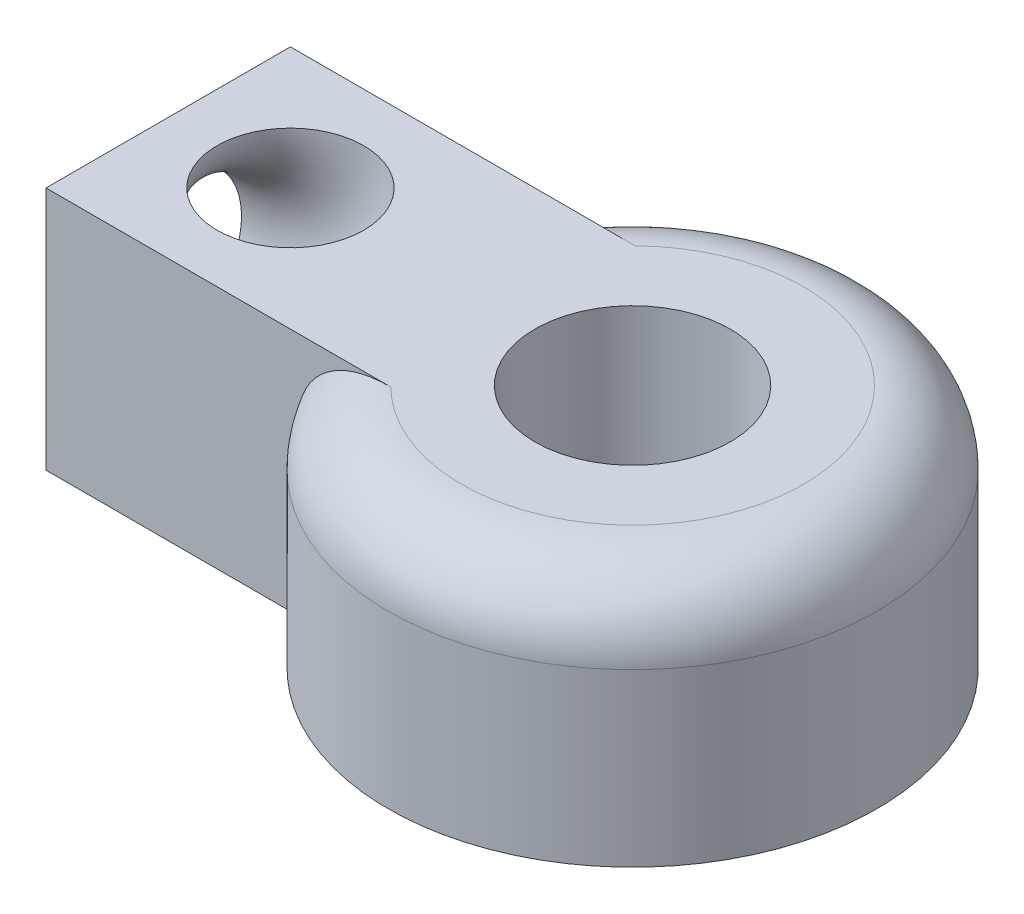
ISO-10303-21;
HEADER;
FILE_DESCRIPTION(('STEP AP214'),'2;1');
FILE_NAME('part.step','',(''),(''),'','','');
FILE_SCHEMA(('AUTOMOTIVE_DESIGN { 1 0 10303 214 1 1 1 1 }'));
ENDSEC;
DATA;
#1=APPLICATION_CONTEXT('core data for automotive mechanical design processes');
#2=APPLICATION_PROTOCOL_DEFINITION('international standard','automotive_design',2000,#1);
#3=PRODUCT_CONTEXT('',#1,'mechanical');
#4=PRODUCT('Part','Part','',(#3));
#5=PRODUCT_RELATED_PRODUCT_CATEGORY('part','',(#4));
#6=PRODUCT_DEFINITION_FORMATION('','',#4);
#7=PRODUCT_DEFINITION_CONTEXT('part definition',#1,'design');
#8=PRODUCT_DEFINITION('design','',#6,#7);
#9=PRODUCT_DEFINITION_SHAPE('','',#8);
#10=(LENGTH_UNIT() NAMED_UNIT(*) SI_UNIT(.MILLI.,.METRE.));
#11=(NAMED_UNIT(*) PLANE_ANGLE_UNIT() SI_UNIT($,.RADIAN.));
#12=(NAMED_UNIT(*) SI_UNIT($,.STERADIAN.) SOLID_ANGLE_UNIT());
#13=UNCERTAINTY_MEASURE_WITH_UNIT(LENGTH_MEASURE(1.E-05),#10,'distance_accuracy_value','');
#14=(GEOMETRIC_REPRESENTATION_CONTEXT(3) GLOBAL_UNCERTAINTY_ASSIGNED_CONTEXT((#13)) GLOBAL_UNIT_ASSIGNED_CONTEXT((#10,
#11,#12)) REPRESENTATION_CONTEXT('',''));
#15=CARTESIAN_POINT('',(0.,0.,0.));
#16=DIRECTION('',(0.,0.,1.));
#17=DIRECTION('',(1.,0.,0.));
#18=AXIS2_PLACEMENT_3D('',#15,#16,#17);
#19=CARTESIAN_POINT('',(0.,10.,0.));
#20=DIRECTION('',(0.,1.,0.));
#21=DIRECTION('',(0.,0.,1.));
#22=AXIS2_PLACEMENT_3D('',#19,#20,#21);
#23=PLANE('',#22);
#24=CARTESIAN_POINT('',(-14.,10.,0.));
#25=DIRECTION('',(0.,1.,0.));
#26=DIRECTION('',(0.,0.,1.));
#27=AXIS2_PLACEMENT_3D('',#24,#25,#26);
#28=CIRCLE('',#27,3.);
#29=CARTESIAN_POINT('',(-11.,10.,0.));
#30=VERTEX_POINT('',#29);
#31=EDGE_CURVE('E116',#30,#30,#28,.F.);
#32=ORIENTED_EDGE('',*,*,#31,.T.);
#33=EDGE_LOOP('',(#32));
#34=FACE_BOUND('',#33,.T.);
#35=CARTESIAN_POINT('',(0.,10.,0.));
#36=DIRECTION('',(0.,1.,0.));
#37=DIRECTION('',(0.,0.,1.));
#38=AXIS2_PLACEMENT_3D('',#35,#36,#37);
#39=CIRCLE('',#38,7.);
#40=CARTESIAN_POINT('',(-4.89897948556636,10.,5.));
#41=VERTEX_POINT('',#40);
#42=CARTESIAN_POINT('',(-4.89897948556636,10.,-5.));
#43=VERTEX_POINT('',#42);
#44=EDGE_CURVE('E133',#41,#43,#39,.T.);
#45=ORIENTED_EDGE('',*,*,#44,.T.);
#46=DIRECTION('',(-1.,0.,0.));
#47=VECTOR('',#46,1.);
#48=CARTESIAN_POINT('',(0.,10.,-5.));
#49=LINE('',#48,#47);
#50=CARTESIAN_POINT('',(-19.,10.,-5.));
#51=VERTEX_POINT('',#50);
#52=EDGE_CURVE('E111',#43,#51,#49,.T.);
#53=ORIENTED_EDGE('',*,*,#52,.T.);
#54=DIRECTION('',(0.,0.,-1.));
#55=VECTOR('',#54,1.);
#56=CARTESIAN_POINT('',(-19.,10.,0.));
#57=LINE('',#56,#55);
#58=CARTESIAN_POINT('',(-19.,10.,5.));
#59=VERTEX_POINT('',#58);
#60=EDGE_CURVE('E119',#59,#51,#57,.T.);
#61=ORIENTED_EDGE('',*,*,#60,.F.);
#62=DIRECTION('',(-1.,0.,0.));
#63=VECTOR('',#62,1.);
#64=CARTESIAN_POINT('',(0.,10.,5.));
#65=LINE('',#64,#63);
#66=EDGE_CURVE('E102',#41,#59,#65,.T.);
#67=ORIENTED_EDGE('',*,*,#66,.F.);
#68=EDGE_LOOP('',(#45,#53,#61,#67));
#69=FACE_BOUND('',#68,.T.);
#70=CARTESIAN_POINT('',(0.,10.,0.));
#71=DIRECTION('',(0.,1.,0.));
#72=DIRECTION('',(0.,0.,1.));
#73=AXIS2_PLACEMENT_3D('',#70,#71,#72);
#74=CIRCLE('',#73,4.);
#75=CARTESIAN_POINT('',(0.,10.,4.));
#76=VERTEX_POINT('',#75);
#77=EDGE_CURVE('E127',#76,#76,#74,.T.);
#78=ORIENTED_EDGE('',*,*,#77,.F.);
#79=EDGE_LOOP('',(#78));
#80=FACE_BOUND('',#79,.T.);
#81=ADVANCED_FACE('F35',(#34,#69,#80),#23,.T.);
#82=CARTESIAN_POINT('',(0.,0.,0.));
#83=DIRECTION('',(0.,1.,0.));
#84=DIRECTION('',(0.,0.,1.));
#85=AXIS2_PLACEMENT_3D('',#82,#83,#84);
#86=PLANE('',#85);
#87=CARTESIAN_POINT('',(0.,0.,0.));
#88=DIRECTION('',(0.,1.,0.));
#89=DIRECTION('',(0.,0.,1.));
#90=AXIS2_PLACEMENT_3D('',#87,#88,#89);
#91=CIRCLE('',#90,10.);
#92=CARTESIAN_POINT('',(-8.66025403784439,0.,5.));
#93=VERTEX_POINT('',#92);
#94=CARTESIAN_POINT('',(-8.66025403784439,0.,-5.));
#95=VERTEX_POINT('',#94);
#96=EDGE_CURVE('E95',#93,#95,#91,.T.);
#97=ORIENTED_EDGE('',*,*,#96,.F.);
#98=DIRECTION('',(-1.,0.,0.));
#99=VECTOR('',#98,1.);
#100=CARTESIAN_POINT('',(0.,0.,5.));
#101=LINE('',#100,#99);
#102=CARTESIAN_POINT('',(-19.,0.,5.));
#103=VERTEX_POINT('',#102);
#104=EDGE_CURVE('E86',#93,#103,#101,.T.);
#105=ORIENTED_EDGE('',*,*,#104,.T.);
#106=DIRECTION('',(0.,0.,-1.));
#107=VECTOR('',#106,1.);
#108=CARTESIAN_POINT('',(-19.,0.,0.));
#109=LINE('',#108,#107);
#110=CARTESIAN_POINT('',(-19.,0.,-5.));
#111=VERTEX_POINT('',#110);
#112=EDGE_CURVE('E92',#103,#111,#109,.T.);
#113=ORIENTED_EDGE('',*,*,#112,.T.);
#114=DIRECTION('',(-1.,0.,0.));
#115=VECTOR('',#114,1.);
#116=CARTESIAN_POINT('',(0.,0.,-5.));
#117=LINE('',#116,#115);
#118=EDGE_CURVE('E97',#95,#111,#117,.T.);
#119=ORIENTED_EDGE('',*,*,#118,.F.);
#120=EDGE_LOOP('',(#97,#105,#113,#119));
#121=FACE_BOUND('',#120,.T.);
#122=CARTESIAN_POINT('',(0.,0.,0.));
#123=DIRECTION('',(0.,1.,0.));
#124=DIRECTION('',(0.,0.,1.));
#125=AXIS2_PLACEMENT_3D('',#122,#123,#124);
#126=CIRCLE('',#125,4.);
#127=CARTESIAN_POINT('',(0.,0.,4.));
#128=VERTEX_POINT('',#127);
#129=EDGE_CURVE('E123',#128,#128,#126,.T.);
#130=ORIENTED_EDGE('',*,*,#129,.T.);
#131=EDGE_LOOP('',(#130));
#132=FACE_BOUND('',#131,.T.);
#133=ADVANCED_FACE('F88',(#121,#132),#86,.F.);
#134=CARTESIAN_POINT('',(0.,10.,0.));
#135=DIRECTION('',(0.,-1.,0.));
#136=DIRECTION('',(0.,0.,-1.));
#137=AXIS2_PLACEMENT_3D('',#134,#135,#136);
#138=CYLINDRICAL_SURFACE('',#137,10.);
#139=DIRECTION('',(0.,1.,0.));
#140=VECTOR('',#139,1.);
#141=CARTESIAN_POINT('',(-8.66025403784439,0.,-5.));
#142=LINE('',#141,#140);
#143=CARTESIAN_POINT('',(-8.66025403784439,7.,-5.));
#144=VERTEX_POINT('',#143);
#145=EDGE_CURVE('E124',#95,#144,#142,.T.);
#146=ORIENTED_EDGE('',*,*,#145,.T.);
#147=CARTESIAN_POINT('',(0.,7.,0.));
#148=DIRECTION('',(0.,1.,0.));
#149=DIRECTION('',(0.,0.,1.));
#150=AXIS2_PLACEMENT_3D('',#147,#148,#149);
#151=CIRCLE('',#150,10.);
#152=CARTESIAN_POINT('',(-8.66025403784439,7.,5.));
#153=VERTEX_POINT('',#152);
#154=EDGE_CURVE('E55',#144,#153,#151,.F.);
#155=ORIENTED_EDGE('',*,*,#154,.T.);
#156=DIRECTION('',(0.,1.,0.));
#157=VECTOR('',#156,1.);
#158=CARTESIAN_POINT('',(-8.66025403784439,0.,5.));
#159=LINE('',#158,#157);
#160=EDGE_CURVE('E106',#93,#153,#159,.T.);
#161=ORIENTED_EDGE('',*,*,#160,.F.);
#162=ORIENTED_EDGE('',*,*,#96,.T.);
#163=EDGE_LOOP('',(#146,#155,#161,#162));
#164=FACE_BOUND('',#163,.T.);
#165=ADVANCED_FACE('F157',(#164),#138,.T.);
#166=CARTESIAN_POINT('',(0.,10.,0.));
#167=DIRECTION('',(0.,-1.,0.));
#168=DIRECTION('',(0.,0.,-1.));
#169=AXIS2_PLACEMENT_3D('',#166,#167,#168);
#170=CYLINDRICAL_SURFACE('',#169,4.);
#171=ORIENTED_EDGE('',*,*,#77,.T.);
#172=EDGE_LOOP('',(#171));
#173=FACE_BOUND('',#172,.T.);
#174=ORIENTED_EDGE('',*,*,#129,.F.);
#175=EDGE_LOOP('',(#174));
#176=FACE_BOUND('',#175,.T.);
#177=ADVANCED_FACE('F153',(#173,#176),#170,.F.);
#178=CARTESIAN_POINT('',(-19.,0.,0.));
#179=DIRECTION('',(1.,0.,0.));
#180=DIRECTION('',(0.,0.,-1.));
#181=AXIS2_PLACEMENT_3D('',#178,#179,#180);
#182=PLANE('',#181);
#183=CARTESIAN_POINT('',(-19.,5.,0.));
#184=DIRECTION('',(1.,0.,0.));
#185=DIRECTION('',(0.,0.,-1.));
#186=AXIS2_PLACEMENT_3D('',#183,#184,#185);
#187=CIRCLE('',#186,3.);
#188=CARTESIAN_POINT('',(-19.,2.,0.));
#189=VERTEX_POINT('',#188);
#190=EDGE_CURVE('E134',#189,#189,#187,.F.);
#191=ORIENTED_EDGE('',*,*,#190,.F.);
#192=EDGE_LOOP('',(#191));
#193=FACE_BOUND('',#192,.T.);
#194=ORIENTED_EDGE('',*,*,#60,.T.);
#195=DIRECTION('',(0.,1.,0.));
#196=VECTOR('',#195,1.);
#197=CARTESIAN_POINT('',(-19.,0.,-5.));
#198=LINE('',#197,#196);
#199=EDGE_CURVE('E109',#111,#51,#198,.T.);
#200=ORIENTED_EDGE('',*,*,#199,.F.);
#201=ORIENTED_EDGE('',*,*,#112,.F.);
#202=DIRECTION('',(0.,1.,0.));
#203=VECTOR('',#202,1.);
#204=CARTESIAN_POINT('',(-19.,0.,5.));
#205=LINE('',#204,#203);
#206=EDGE_CURVE('E100',#103,#59,#205,.T.);
#207=ORIENTED_EDGE('',*,*,#206,.T.);
#208=EDGE_LOOP('',(#194,#200,#201,#207));
#209=FACE_BOUND('',#208,.T.);
#210=ADVANCED_FACE('F108',(#193,#209),#182,.F.);
#211=CARTESIAN_POINT('',(0.,0.,-5.));
#212=DIRECTION('',(0.,0.,-1.));
#213=DIRECTION('',(-1.,0.,0.));
#214=AXIS2_PLACEMENT_3D('',#211,#212,#213);
#215=PLANE('',#214);
#216=ORIENTED_EDGE('',*,*,#52,.F.);
#217=CARTESIAN_POINT('',(-4.89897948556636,10.,-5.));
#218=CARTESIAN_POINT('',(-5.0250883856782,10.0000089059584,-5.));
#219=CARTESIAN_POINT('',(-5.15126165064474,9.99610380068325,-5.));
#220=CARTESIAN_POINT('',(-5.40325690253533,9.97958946400486,-5.));
#221=CARTESIAN_POINT('',(-5.52907783605023,9.96696444536859,-5.));
#222=CARTESIAN_POINT('',(-5.78042203996206,9.9319891746772,-5.));
#223=CARTESIAN_POINT('',(-5.90593496453167,9.90956229226585,-5.));
#224=CARTESIAN_POINT('',(-6.15452836617288,9.85421451178789,-5.));
#225=CARTESIAN_POINT('',(-6.27761054334346,9.82130124558646,-5.));
#226=CARTESIAN_POINT('',(-6.58761522270322,9.72291150144527,-5.));
#227=CARTESIAN_POINT('',(-6.77211239524566,9.64949752772999,-5.));
#228=CARTESIAN_POINT('',(-7.12666731054608,9.47404722204405,-5.));
#229=CARTESIAN_POINT('',(-7.29676225961562,9.3720877667627,-5.));
#230=CARTESIAN_POINT('',(-7.53700072480482,9.1971975292852,-5.));
#231=CARTESIAN_POINT('',(-7.61497492910538,9.13484627450905,-5.));
#232=CARTESIAN_POINT('',(-7.7646696411004,9.00306278468092,-5.));
#233=CARTESIAN_POINT('',(-7.83639333937723,8.93363420200228,-5.));
#234=CARTESIAN_POINT('',(-7.97267265050241,8.78799339176832,-5.));
#235=CARTESIAN_POINT('',(-8.0372246845529,8.71177781124238,-5.));
#236=CARTESIAN_POINT('',(-8.15815827009472,8.55312114696996,-5.));
#237=CARTESIAN_POINT('',(-8.21454166835135,8.47068147679684,-5.));
#238=CARTESIAN_POINT('',(-8.31100673022617,8.31216020446215,-5.));
#239=CARTESIAN_POINT('',(-8.35226513912408,8.23679275576334,-5.));
#240=CARTESIAN_POINT('',(-8.42753318938288,8.08252651226033,-5.));
#241=CARTESIAN_POINT('',(-8.46154411033291,8.00362834380807,-5.));
#242=CARTESIAN_POINT('',(-8.52180834451539,7.8430815389408,-5.));
#243=CARTESIAN_POINT('',(-8.5480754170158,7.76143807156151,-5.));
#244=CARTESIAN_POINT('',(-8.59255419697178,7.59602364716643,-5.));
#245=CARTESIAN_POINT('',(-8.61077022781038,7.51225385759839,-5.));
#246=CARTESIAN_POINT('',(-8.63660855749361,7.35709457673049,-5.));
#247=CARTESIAN_POINT('',(-8.64547261240958,7.28590944669821,-5.));
#248=CARTESIAN_POINT('',(-8.65729604609621,7.14315212238966,-5.));
#249=CARTESIAN_POINT('',(-8.66026373402127,7.07158061551546,-5.));
#250=CARTESIAN_POINT('',(-8.66025403784439,7.,-5.));
#251=B_SPLINE_CURVE_WITH_KNOTS('',3,(#217,#218,#219,#220,#221,#222,#223,#224,#225,#226,#227,
#228,#229,#230,#231,#232,#233,#234,#235,#236,#237,#238,#239,#240,#241,#242,#243,#244,#245,#246,
#247,#248,#249,#250),.UNSPECIFIED.,.F.,.F.,(4,2,2,2,2,2,2,2,2,2,2,2,2,2,2,2,4),(0.,
0.378360536352475,0.757407888880226,1.1394731523997,1.52126098611825,2.11464861992593,
2.70645330698984,3.00559380442891,3.30458069954219,3.60371613096823,3.90278382796223,
4.16018900764245,4.41754870311164,4.67444832719721,4.93120982891294,5.14617654521848,
5.36084011517806),.UNSPECIFIED.);
#252=EDGE_CURVE('E48',#43,#144,#251,.T.);
#253=ORIENTED_EDGE('',*,*,#252,.T.);
#254=ORIENTED_EDGE('',*,*,#145,.F.);
#255=ORIENTED_EDGE('',*,*,#118,.T.);
#256=ORIENTED_EDGE('',*,*,#199,.T.);
#257=EDGE_LOOP('',(#216,#253,#254,#255,#256));
#258=FACE_BOUND('',#257,.T.);
#259=ADVANCED_FACE('F143',(#258),#215,.T.);
#260=CARTESIAN_POINT('',(0.,0.,5.));
#261=DIRECTION('',(0.,0.,-1.));
#262=DIRECTION('',(-1.,0.,0.));
#263=AXIS2_PLACEMENT_3D('',#260,#261,#262);
#264=PLANE('',#263);
#265=ORIENTED_EDGE('',*,*,#66,.T.);
#266=ORIENTED_EDGE('',*,*,#206,.F.);
#267=ORIENTED_EDGE('',*,*,#104,.F.);
#268=ORIENTED_EDGE('',*,*,#160,.T.);
#269=CARTESIAN_POINT('',(-8.66025403784439,7.,5.));
#270=CARTESIAN_POINT('',(-8.66026657926528,7.07549714883776,5.));
#271=CARTESIAN_POINT('',(-8.65696352782162,7.15098821987244,5.));
#272=CARTESIAN_POINT('',(-8.64382235383665,7.30138134770999,5.));
#273=CARTESIAN_POINT('',(-8.63398583887728,7.37628354482121,5.));
#274=CARTESIAN_POINT('',(-8.60792051176338,7.52469359065237,5.));
#275=CARTESIAN_POINT('',(-8.59171471299251,7.59820547154684,5.));
#276=CARTESIAN_POINT('',(-8.55310864574803,7.7435645500866,5.));
#277=CARTESIAN_POINT('',(-8.53070822753756,7.81541170744655,5.));
#278=CARTESIAN_POINT('',(-8.45457239925533,8.02763481387258,5.));
#279=CARTESIAN_POINT('',(-8.39186517116389,8.16490070376963,5.));
#280=CARTESIAN_POINT('',(-8.24512656631645,8.42746535909483,5.));
#281=CARTESIAN_POINT('',(-8.16108064616767,8.55275588222165,5.));
#282=CARTESIAN_POINT('',(-7.97116564815884,8.79347724473562,5.));
#283=CARTESIAN_POINT('',(-7.86457954493587,8.90834097970688,5.));
#284=CARTESIAN_POINT('',(-7.63552982041177,9.1207348095157,5.));
#285=CARTESIAN_POINT('',(-7.51307022301636,9.21826928248908,5.));
#286=CARTESIAN_POINT('',(-7.24072060928002,9.40576888209922,5.));
#287=CARTESIAN_POINT('',(-7.08929818950007,9.49349886506648,5.));
#288=CARTESIAN_POINT('',(-6.77525480362723,9.6468672807818,5.));
#289=CARTESIAN_POINT('',(-6.61260398948719,9.71244386875362,5.));
#290=CARTESIAN_POINT('',(-6.32177393491098,9.80863725914136,5.));
#291=CARTESIAN_POINT('',(-6.19508637256004,9.84389276526392,5.));
#292=CARTESIAN_POINT('',(-5.93899193474873,9.90317049475031,5.));
#293=CARTESIAN_POINT('',(-5.80958257942688,9.92718196520127,5.));
#294=CARTESIAN_POINT('',(-5.55013691280789,9.96464707430749,5.));
#295=CARTESIAN_POINT('',(-5.42010998377444,9.97816760939509,5.));
#296=CARTESIAN_POINT('',(-5.15968928501872,9.99583934306667,5.));
#297=CARTESIAN_POINT('',(-5.02929689988221,10.0000105711839,5.));
#298=CARTESIAN_POINT('',(-4.89897948556635,10.,5.));
#299=B_SPLINE_CURVE_WITH_KNOTS('',3,(#269,#270,#271,#272,#273,#274,#275,#276,#277,#278,#279,
#280,#281,#282,#283,#284,#285,#286,#287,#288,#289,#290,#291,#292,#293,#294,#295,#296,#297,#298),
.UNSPECIFIED.,.F.,.F.,(4,2,2,2,2,2,2,2,2,2,2,2,2,2,4),(0.,0.226408916785836,0.452762145479534,
0.678304928359647,0.903853163556027,1.35432290671677,1.80510049572682,2.27327447047653,
2.74132999511898,3.26436915022835,3.7888566150344,4.1828528853424,4.57722517712386,
4.9690615655767,5.3600576958056),.UNSPECIFIED.);
#300=EDGE_CURVE('E11',#153,#41,#299,.T.);
#301=ORIENTED_EDGE('',*,*,#300,.T.);
#302=EDGE_LOOP('',(#265,#266,#267,#268,#301));
#303=FACE_BOUND('',#302,.T.);
#304=ADVANCED_FACE('F101',(#303),#264,.F.);
#305=CARTESIAN_POINT('',(-19.,10.,0.));
#306=DIRECTION('',(0.,0.,1.));
#307=DIRECTION('',(1.,0.,0.));
#308=AXIS2_PLACEMENT_3D('',#305,#306,#307);
#309=TOROIDAL_SURFACE('',#308,5.,3.);
#310=CARTESIAN_POINT('',(-19.,10.,0.));
#311=DIRECTION('',(0.,0.,1.));
#312=DIRECTION('',(1.,0.,0.));
#313=AXIS2_PLACEMENT_3D('',#310,#311,#312);
#314=CIRCLE('',#313,8.);
#315=EDGE_CURVE('',#189,#30,#314,.T.);
#316=ORIENTED_EDGE('',*,*,#190,.T.);
#317=ORIENTED_EDGE('',*,*,#31,.F.);
#318=ORIENTED_EDGE('',*,*,#315,.T.);
#319=ORIENTED_EDGE('',*,*,#315,.F.);
#320=EDGE_LOOP('',(#316,#318,#317,#319));
#321=FACE_BOUND('',#320,.T.);
#322=ADVANCED_FACE('F147',(#321),#309,.F.);
#323=CARTESIAN_POINT('',(0.,7.,0.));
#324=DIRECTION('',(0.,1.,0.));
#325=DIRECTION('',(0.,0.,1.));
#326=AXIS2_PLACEMENT_3D('',#323,#324,#325);
#327=TOROIDAL_SURFACE('',#326,7.,3.);
#328=ORIENTED_EDGE('',*,*,#300,.F.);
#329=ORIENTED_EDGE('',*,*,#154,.F.);
#330=ORIENTED_EDGE('',*,*,#252,.F.);
#331=ORIENTED_EDGE('',*,*,#44,.F.);
#332=EDGE_LOOP('',(#328,#329,#330,#331));
#333=FACE_BOUND('',#332,.T.);
#334=ADVANCED_FACE('F37',(#333),#327,.T.);
#335=CLOSED_SHELL('',(#81,#133,#165,#177,#210,#259,#304,#322,#334));
#336=MANIFOLD_SOLID_BREP('B2',#335);
#337=ADVANCED_BREP_SHAPE_REPRESENTATION('',(#18,#336),#14);
#338=SHAPE_DEFINITION_REPRESENTATION(#9,#337);
ENDSEC;
END-ISO-10303-21;
